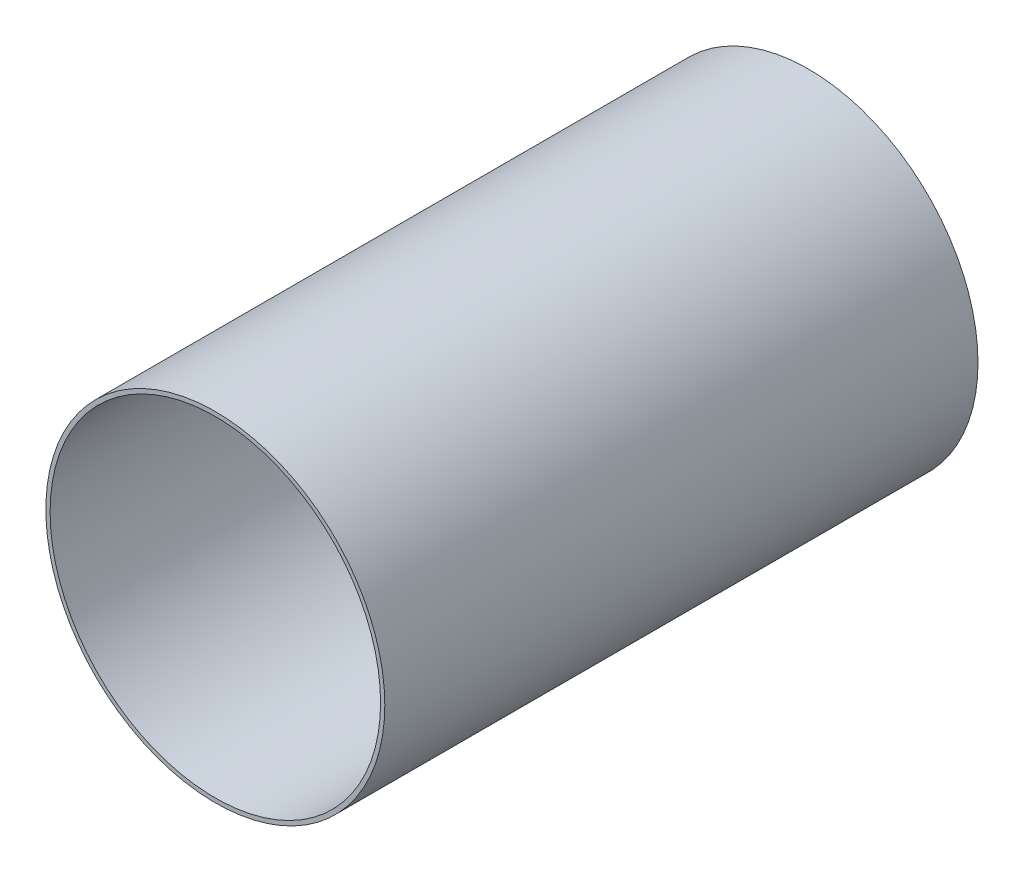
ISO-10303-21;
HEADER;
FILE_DESCRIPTION(('STEP AP214'),'2;1');
FILE_NAME('part.step','',(''),(''),'','','');
FILE_SCHEMA(('AUTOMOTIVE_DESIGN { 1 0 10303 214 1 1 1 1 }'));
ENDSEC;
DATA;
#1=APPLICATION_CONTEXT('core data for automotive mechanical design processes');
#2=APPLICATION_PROTOCOL_DEFINITION('international standard','automotive_design',2000,#1);
#3=PRODUCT_CONTEXT('',#1,'mechanical');
#4=PRODUCT('Part','Part','',(#3));
#5=PRODUCT_RELATED_PRODUCT_CATEGORY('part','',(#4));
#6=PRODUCT_DEFINITION_FORMATION('','',#4);
#7=PRODUCT_DEFINITION_CONTEXT('part definition',#1,'design');
#8=PRODUCT_DEFINITION('design','',#6,#7);
#9=PRODUCT_DEFINITION_SHAPE('','',#8);
#10=(LENGTH_UNIT() NAMED_UNIT(*) SI_UNIT(.MILLI.,.METRE.));
#11=(NAMED_UNIT(*) PLANE_ANGLE_UNIT() SI_UNIT($,.RADIAN.));
#12=(NAMED_UNIT(*) SI_UNIT($,.STERADIAN.) SOLID_ANGLE_UNIT());
#13=UNCERTAINTY_MEASURE_WITH_UNIT(LENGTH_MEASURE(1.E-05),#10,'distance_accuracy_value','');
#14=(GEOMETRIC_REPRESENTATION_CONTEXT(3) GLOBAL_UNCERTAINTY_ASSIGNED_CONTEXT((#13)) GLOBAL_UNIT_ASSIGNED_CONTEXT((#10,
#11,#12)) REPRESENTATION_CONTEXT('',''));
#15=CARTESIAN_POINT('',(0.,0.,0.));
#16=DIRECTION('',(0.,0.,1.));
#17=DIRECTION('',(1.,0.,0.));
#18=AXIS2_PLACEMENT_3D('',#15,#16,#17);
#19=CARTESIAN_POINT('',(0.,40.,70.));
#20=DIRECTION('',(0.,0.,1.));
#21=DIRECTION('',(1.,0.,0.));
#22=AXIS2_PLACEMENT_3D('',#19,#20,#21);
#23=PLANE('',#22);
#24=CARTESIAN_POINT('',(0.,40.,70.));
#25=DIRECTION('',(0.,0.,1.));
#26=DIRECTION('',(1.,0.,0.));
#27=AXIS2_PLACEMENT_3D('',#24,#25,#26);
#28=CIRCLE('',#27,20.);
#29=CARTESIAN_POINT('',(20.,40.,70.));
#30=VERTEX_POINT('',#29);
#31=EDGE_CURVE('E10',#30,#30,#28,.T.);
#32=ORIENTED_EDGE('',*,*,#31,.T.);
#33=EDGE_LOOP('',(#32));
#34=FACE_BOUND('',#33,.T.);
#35=CARTESIAN_POINT('',(0.,40.,70.));
#36=DIRECTION('',(0.,0.,1.));
#37=DIRECTION('',(1.,0.,0.));
#38=AXIS2_PLACEMENT_3D('',#35,#36,#37);
#39=CIRCLE('',#38,19.5);
#40=CARTESIAN_POINT('',(19.5,40.,70.));
#41=VERTEX_POINT('',#40);
#42=EDGE_CURVE('E46',#41,#41,#39,.T.);
#43=ORIENTED_EDGE('',*,*,#42,.F.);
#44=EDGE_LOOP('',(#43));
#45=FACE_BOUND('',#44,.T.);
#46=ADVANCED_FACE('F35',(#34,#45),#23,.T.);
#47=CARTESIAN_POINT('',(0.,40.,0.));
#48=DIRECTION('',(0.,0.,1.));
#49=DIRECTION('',(1.,0.,0.));
#50=AXIS2_PLACEMENT_3D('',#47,#48,#49);
#51=PLANE('',#50);
#52=CARTESIAN_POINT('',(0.,40.,0.));
#53=DIRECTION('',(0.,0.,1.));
#54=DIRECTION('',(1.,0.,0.));
#55=AXIS2_PLACEMENT_3D('',#52,#53,#54);
#56=CIRCLE('',#55,20.);
#57=CARTESIAN_POINT('',(20.,40.,0.));
#58=VERTEX_POINT('',#57);
#59=EDGE_CURVE('E39',#58,#58,#56,.T.);
#60=ORIENTED_EDGE('',*,*,#59,.F.);
#61=EDGE_LOOP('',(#60));
#62=FACE_BOUND('',#61,.T.);
#63=CARTESIAN_POINT('',(0.,40.,0.));
#64=DIRECTION('',(0.,0.,1.));
#65=DIRECTION('',(1.,0.,0.));
#66=AXIS2_PLACEMENT_3D('',#63,#64,#65);
#67=CIRCLE('',#66,19.5);
#68=CARTESIAN_POINT('',(19.5,40.,0.));
#69=VERTEX_POINT('',#68);
#70=EDGE_CURVE('E48',#69,#69,#67,.T.);
#71=ORIENTED_EDGE('',*,*,#70,.T.);
#72=EDGE_LOOP('',(#71));
#73=FACE_BOUND('',#72,.T.);
#74=ADVANCED_FACE('F58',(#62,#73),#51,.F.);
#75=CARTESIAN_POINT('',(0.,40.,70.));
#76=DIRECTION('',(0.,0.,-1.));
#77=DIRECTION('',(-1.,0.,0.));
#78=AXIS2_PLACEMENT_3D('',#75,#76,#77);
#79=CYLINDRICAL_SURFACE('',#78,20.);
#80=ORIENTED_EDGE('',*,*,#31,.F.);
#81=EDGE_LOOP('',(#80));
#82=FACE_BOUND('',#81,.T.);
#83=ORIENTED_EDGE('',*,*,#59,.T.);
#84=EDGE_LOOP('',(#83));
#85=FACE_BOUND('',#84,.T.);
#86=ADVANCED_FACE('F37',(#82,#85),#79,.T.);
#87=CARTESIAN_POINT('',(0.,40.,70.));
#88=DIRECTION('',(0.,0.,-1.));
#89=DIRECTION('',(-1.,0.,0.));
#90=AXIS2_PLACEMENT_3D('',#87,#88,#89);
#91=CYLINDRICAL_SURFACE('',#90,19.5);
#92=ORIENTED_EDGE('',*,*,#42,.T.);
#93=EDGE_LOOP('',(#92));
#94=FACE_BOUND('',#93,.T.);
#95=ORIENTED_EDGE('',*,*,#70,.F.);
#96=EDGE_LOOP('',(#95));
#97=FACE_BOUND('',#96,.T.);
#98=ADVANCED_FACE('F54',(#94,#97),#91,.F.);
#99=CLOSED_SHELL('',(#46,#74,#86,#98));
#100=MANIFOLD_SOLID_BREP('B2',#99);
#101=ADVANCED_BREP_SHAPE_REPRESENTATION('',(#18,#100),#14);
#102=SHAPE_DEFINITION_REPRESENTATION(#9,#101);
ENDSEC;
END-ISO-10303-21;
